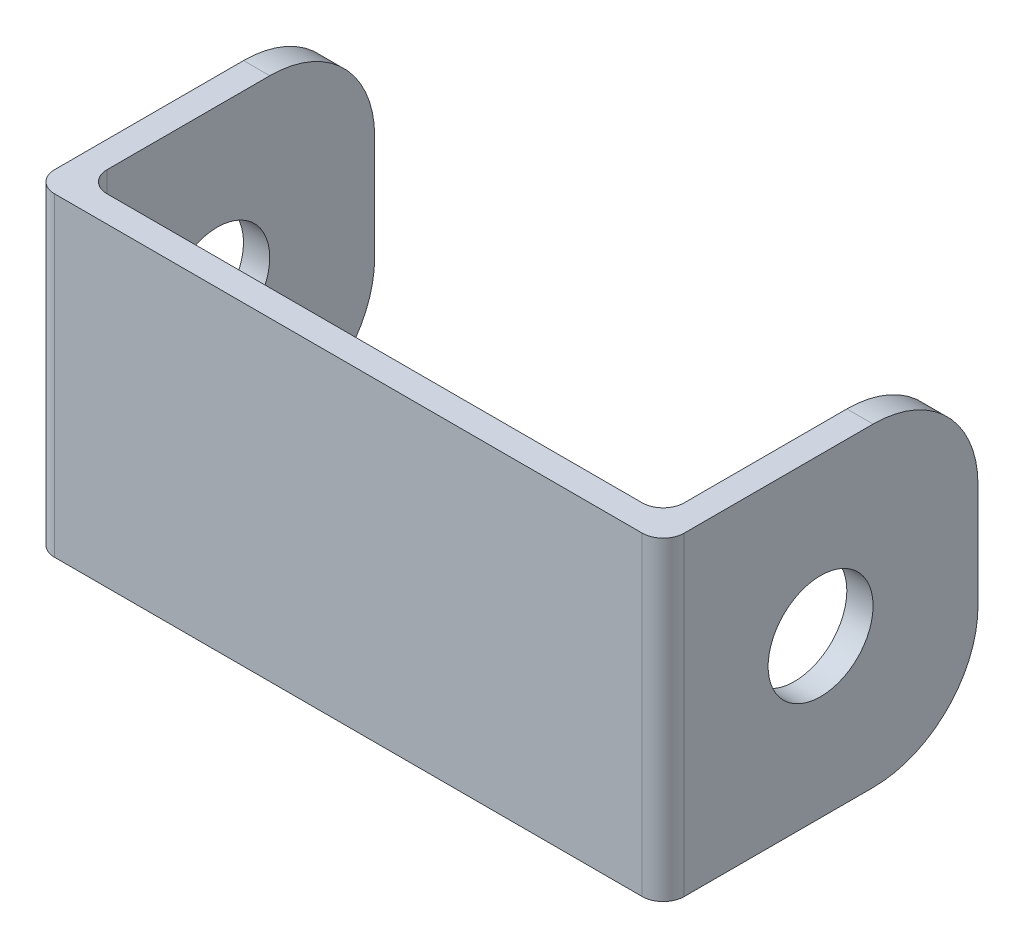
ISO-10303-21;
HEADER;
FILE_DESCRIPTION(('STEP AP214'),'2;1');
FILE_NAME('part.step','',(''),(''),'','','');
FILE_SCHEMA(('AUTOMOTIVE_DESIGN { 1 0 10303 214 1 1 1 1 }'));
ENDSEC;
DATA;
#1=APPLICATION_CONTEXT('core data for automotive mechanical design processes');
#2=APPLICATION_PROTOCOL_DEFINITION('international standard','automotive_design',2000,#1);
#3=PRODUCT_CONTEXT('',#1,'mechanical');
#4=PRODUCT('Part','Part','',(#3));
#5=PRODUCT_RELATED_PRODUCT_CATEGORY('part','',(#4));
#6=PRODUCT_DEFINITION_FORMATION('','',#4);
#7=PRODUCT_DEFINITION_CONTEXT('part definition',#1,'design');
#8=PRODUCT_DEFINITION('design','',#6,#7);
#9=PRODUCT_DEFINITION_SHAPE('','',#8);
#10=(LENGTH_UNIT() NAMED_UNIT(*) SI_UNIT(.MILLI.,.METRE.));
#11=(NAMED_UNIT(*) PLANE_ANGLE_UNIT() SI_UNIT($,.RADIAN.));
#12=(NAMED_UNIT(*) SI_UNIT($,.STERADIAN.) SOLID_ANGLE_UNIT());
#13=UNCERTAINTY_MEASURE_WITH_UNIT(LENGTH_MEASURE(1.E-05),#10,'distance_accuracy_value','');
#14=(GEOMETRIC_REPRESENTATION_CONTEXT(3) GLOBAL_UNCERTAINTY_ASSIGNED_CONTEXT((#13)) GLOBAL_UNIT_ASSIGNED_CONTEXT((#10,
#11,#12)) REPRESENTATION_CONTEXT('',''));
#15=CARTESIAN_POINT('',(0.,0.,0.));
#16=DIRECTION('',(0.,0.,1.));
#17=DIRECTION('',(1.,0.,0.));
#18=AXIS2_PLACEMENT_3D('',#15,#16,#17);
#19=CARTESIAN_POINT('',(-2.38125000000001,38.1,-27.9796875));
#20=DIRECTION('',(0.,0.,1.));
#21=DIRECTION('',(1.,0.,0.));
#22=AXIS2_PLACEMENT_3D('',#19,#20,#21);
#23=PLANE('',#22);
#24=DIRECTION('',(0.,-1.,0.));
#25=VECTOR('',#24,1.);
#26=CARTESIAN_POINT('',(-5.55625000000001,38.1,-27.9796875));
#27=LINE('',#26,#25);
#28=CARTESIAN_POINT('',(-5.55625000000001,25.4,-27.9796875));
#29=VERTEX_POINT('',#28);
#30=CARTESIAN_POINT('',(-5.55625000000001,12.7,-27.9796875));
#31=VERTEX_POINT('',#30);
#32=EDGE_CURVE('E209',#29,#31,#27,.T.);
#33=ORIENTED_EDGE('',*,*,#32,.F.);
#34=DIRECTION('',(-1.,0.,0.));
#35=VECTOR('',#34,1.);
#36=CARTESIAN_POINT('',(-2.38125000000001,25.4,-27.9796875));
#37=LINE('',#36,#35);
#38=CARTESIAN_POINT('',(-2.38125000000001,25.4,-27.9796875));
#39=VERTEX_POINT('',#38);
#40=EDGE_CURVE('E150',#29,#39,#37,.F.);
#41=ORIENTED_EDGE('',*,*,#40,.T.);
#42=DIRECTION('',(0.,-1.,0.));
#43=VECTOR('',#42,1.);
#44=CARTESIAN_POINT('',(-2.38125000000001,38.1,-27.9796875));
#45=LINE('',#44,#43);
#46=CARTESIAN_POINT('',(-2.38125000000001,12.7,-27.9796875));
#47=VERTEX_POINT('',#46);
#48=EDGE_CURVE('E189',#39,#47,#45,.T.);
#49=ORIENTED_EDGE('',*,*,#48,.T.);
#50=DIRECTION('',(-1.,0.,0.));
#51=VECTOR('',#50,1.);
#52=CARTESIAN_POINT('',(-2.38125000000001,12.7,-27.9796875));
#53=LINE('',#52,#51);
#54=EDGE_CURVE('E155',#47,#31,#53,.T.);
#55=ORIENTED_EDGE('',*,*,#54,.T.);
#56=EDGE_LOOP('',(#33,#41,#49,#55));
#57=FACE_BOUND('',#56,.T.);
#58=ADVANCED_FACE('F32',(#57),#23,.F.);
#59=CARTESIAN_POINT('',(-5.55625000000001,38.1,-27.9796875));
#60=DIRECTION('',(1.,0.,0.));
#61=DIRECTION('',(0.,0.,-1.));
#62=AXIS2_PLACEMENT_3D('',#59,#60,#61);
#63=PLANE('',#62);
#64=CARTESIAN_POINT('',(-5.55625000000003,19.05,-8.92968749999998));
#65=DIRECTION('',(1.,0.,0.));
#66=DIRECTION('',(0.,0.,-1.));
#67=AXIS2_PLACEMENT_3D('',#64,#65,#66);
#68=CIRCLE('',#67,6.35);
#69=CARTESIAN_POINT('',(-5.55625000000003,19.05,-15.2796875));
#70=VERTEX_POINT('',#69);
#71=EDGE_CURVE('E214',#70,#70,#68,.T.);
#72=ORIENTED_EDGE('',*,*,#71,.T.);
#73=EDGE_LOOP('',(#72));
#74=FACE_BOUND('',#73,.T.);
#75=DIRECTION('',(0.,0.,1.));
#76=VECTOR('',#75,1.);
#77=CARTESIAN_POINT('',(-5.55625000000001,0.,-27.9796875));
#78=LINE('',#77,#76);
#79=CARTESIAN_POINT('',(-5.55625000000001,0.,-15.2796875));
#80=VERTEX_POINT('',#79);
#81=CARTESIAN_POINT('',(-5.55625,0.,7.58031249999998));
#82=VERTEX_POINT('',#81);
#83=EDGE_CURVE('E190',#80,#82,#78,.T.);
#84=ORIENTED_EDGE('',*,*,#83,.T.);
#85=DIRECTION('',(0.,-1.,0.));
#86=VECTOR('',#85,1.);
#87=CARTESIAN_POINT('',(-5.55625,38.1,7.5803125));
#88=LINE('',#87,#86);
#89=CARTESIAN_POINT('',(-5.55625,38.1,7.58031249999998));
#90=VERTEX_POINT('',#89);
#91=EDGE_CURVE('E171',#82,#90,#88,.F.);
#92=ORIENTED_EDGE('',*,*,#91,.T.);
#93=DIRECTION('',(0.,0.,1.));
#94=VECTOR('',#93,1.);
#95=CARTESIAN_POINT('',(-5.55625000000001,38.1,-27.9796875));
#96=LINE('',#95,#94);
#97=CARTESIAN_POINT('',(-5.55625000000001,38.1,-15.2796875));
#98=VERTEX_POINT('',#97);
#99=EDGE_CURVE('E161',#98,#90,#96,.T.);
#100=ORIENTED_EDGE('',*,*,#99,.F.);
#101=CARTESIAN_POINT('',(-5.55625000000001,25.4,-15.2796875));
#102=DIRECTION('',(1.,0.,0.));
#103=DIRECTION('',(0.,0.,-1.));
#104=AXIS2_PLACEMENT_3D('',#101,#102,#103);
#105=CIRCLE('',#104,12.7);
#106=EDGE_CURVE('E145',#98,#29,#105,.F.);
#107=ORIENTED_EDGE('',*,*,#106,.T.);
#108=ORIENTED_EDGE('',*,*,#32,.T.);
#109=CARTESIAN_POINT('',(-5.55625000000001,12.7,-15.2796875));
#110=DIRECTION('',(1.,0.,0.));
#111=DIRECTION('',(0.,0.,-1.));
#112=AXIS2_PLACEMENT_3D('',#109,#110,#111);
#113=CIRCLE('',#112,12.7);
#114=EDGE_CURVE('E156',#31,#80,#113,.F.);
#115=ORIENTED_EDGE('',*,*,#114,.T.);
#116=EDGE_LOOP('',(#84,#92,#100,#107,#108,#115));
#117=FACE_BOUND('',#116,.T.);
#118=ADVANCED_FACE('F169',(#74,#117),#63,.F.);
#119=CARTESIAN_POINT('',(-5.55625,38.1,10.1203125));
#120=DIRECTION('',(0.,0.,-1.));
#121=DIRECTION('',(-1.,0.,0.));
#122=AXIS2_PLACEMENT_3D('',#119,#120,#121);
#123=PLANE('',#122);
#124=DIRECTION('',(1.,0.,0.));
#125=VECTOR('',#124,1.);
#126=CARTESIAN_POINT('',(-5.55625,0.,10.1203125));
#127=LINE('',#126,#125);
#128=CARTESIAN_POINT('',(-3.01625000000001,0.,10.1203125));
#129=VERTEX_POINT('',#128);
#130=CARTESIAN_POINT('',(68.10375,0.,10.1203125));
#131=VERTEX_POINT('',#130);
#132=EDGE_CURVE('E192',#129,#131,#127,.T.);
#133=ORIENTED_EDGE('',*,*,#132,.T.);
#134=DIRECTION('',(0.,-1.,0.));
#135=VECTOR('',#134,1.);
#136=CARTESIAN_POINT('',(68.10375,38.1,10.1203125));
#137=LINE('',#136,#135);
#138=CARTESIAN_POINT('',(68.10375,38.1,10.1203125));
#139=VERTEX_POINT('',#138);
#140=EDGE_CURVE('E255',#131,#139,#137,.F.);
#141=ORIENTED_EDGE('',*,*,#140,.T.);
#142=DIRECTION('',(1.,0.,0.));
#143=VECTOR('',#142,1.);
#144=CARTESIAN_POINT('',(-5.55625,38.1,10.1203125));
#145=LINE('',#144,#143);
#146=CARTESIAN_POINT('',(-3.01625000000001,38.1,10.1203125));
#147=VERTEX_POINT('',#146);
#148=EDGE_CURVE('E172',#147,#139,#145,.T.);
#149=ORIENTED_EDGE('',*,*,#148,.F.);
#150=DIRECTION('',(0.,-1.,0.));
#151=VECTOR('',#150,1.);
#152=CARTESIAN_POINT('',(-3.01625000000001,38.1,10.1203125));
#153=LINE('',#152,#151);
#154=EDGE_CURVE('E252',#147,#129,#153,.T.);
#155=ORIENTED_EDGE('',*,*,#154,.T.);
#156=EDGE_LOOP('',(#133,#141,#149,#155));
#157=FACE_BOUND('',#156,.T.);
#158=ADVANCED_FACE('F308',(#157),#123,.F.);
#159=CARTESIAN_POINT('',(70.64375,38.1,10.1203125));
#160=DIRECTION('',(-1.,0.,0.));
#161=DIRECTION('',(0.,0.,1.));
#162=AXIS2_PLACEMENT_3D('',#159,#160,#161);
#163=PLANE('',#162);
#164=CARTESIAN_POINT('',(70.64375,19.05,-8.92968750000001));
#165=DIRECTION('',(1.,0.,0.));
#166=DIRECTION('',(0.,0.,-1.));
#167=AXIS2_PLACEMENT_3D('',#164,#165,#166);
#168=CIRCLE('',#167,6.35);
#169=CARTESIAN_POINT('',(70.64375,19.05,-15.2796875));
#170=VERTEX_POINT('',#169);
#171=EDGE_CURVE('E498',#170,#170,#168,.T.);
#172=ORIENTED_EDGE('',*,*,#171,.F.);
#173=EDGE_LOOP('',(#172));
#174=FACE_BOUND('',#173,.T.);
#175=DIRECTION('',(0.,0.,-1.));
#176=VECTOR('',#175,1.);
#177=CARTESIAN_POINT('',(70.64375,38.1,10.1203125));
#178=LINE('',#177,#176);
#179=CARTESIAN_POINT('',(70.64375,38.1,7.58031250000001));
#180=VERTEX_POINT('',#179);
#181=CARTESIAN_POINT('',(70.64375,38.1,-15.2796875));
#182=VERTEX_POINT('',#181);
#183=EDGE_CURVE('E175',#180,#182,#178,.T.);
#184=ORIENTED_EDGE('',*,*,#183,.F.);
#185=DIRECTION('',(0.,-1.,0.));
#186=VECTOR('',#185,1.);
#187=CARTESIAN_POINT('',(70.64375,38.1,7.58031250000001));
#188=LINE('',#187,#186);
#189=CARTESIAN_POINT('',(70.64375,0.,7.58031250000001));
#190=VERTEX_POINT('',#189);
#191=EDGE_CURVE('E245',#180,#190,#188,.T.);
#192=ORIENTED_EDGE('',*,*,#191,.T.);
#193=DIRECTION('',(0.,0.,-1.));
#194=VECTOR('',#193,1.);
#195=CARTESIAN_POINT('',(70.64375,0.,10.1203125));
#196=LINE('',#195,#194);
#197=CARTESIAN_POINT('',(70.64375,0.,-15.2796875));
#198=VERTEX_POINT('',#197);
#199=EDGE_CURVE('E195',#190,#198,#196,.T.);
#200=ORIENTED_EDGE('',*,*,#199,.T.);
#201=CARTESIAN_POINT('',(70.64375,12.7,-15.2796875));
#202=DIRECTION('',(-1.,0.,0.));
#203=DIRECTION('',(0.,0.,1.));
#204=AXIS2_PLACEMENT_3D('',#201,#202,#203);
#205=CIRCLE('',#204,12.7);
#206=CARTESIAN_POINT('',(70.64375,12.7,-27.9796875));
#207=VERTEX_POINT('',#206);
#208=EDGE_CURVE('E243',#198,#207,#205,.F.);
#209=ORIENTED_EDGE('',*,*,#208,.T.);
#210=DIRECTION('',(0.,-1.,0.));
#211=VECTOR('',#210,1.);
#212=CARTESIAN_POINT('',(70.64375,38.1,-27.9796875));
#213=LINE('',#212,#211);
#214=CARTESIAN_POINT('',(70.64375,25.4,-27.9796875));
#215=VERTEX_POINT('',#214);
#216=EDGE_CURVE('E206',#215,#207,#213,.T.);
#217=ORIENTED_EDGE('',*,*,#216,.F.);
#218=CARTESIAN_POINT('',(70.64375,25.4,-15.2796875));
#219=DIRECTION('',(-1.,0.,0.));
#220=DIRECTION('',(0.,0.,1.));
#221=AXIS2_PLACEMENT_3D('',#218,#219,#220);
#222=CIRCLE('',#221,12.7);
#223=EDGE_CURVE('E240',#215,#182,#222,.F.);
#224=ORIENTED_EDGE('',*,*,#223,.T.);
#225=EDGE_LOOP('',(#184,#192,#200,#209,#217,#224));
#226=FACE_BOUND('',#225,.T.);
#227=ADVANCED_FACE('F316',(#174,#226),#163,.F.);
#228=CARTESIAN_POINT('',(70.64375,38.1,-27.9796875));
#229=DIRECTION('',(0.,0.,1.));
#230=DIRECTION('',(1.,0.,0.));
#231=AXIS2_PLACEMENT_3D('',#228,#229,#230);
#232=PLANE('',#231);
#233=ORIENTED_EDGE('',*,*,#216,.T.);
#234=DIRECTION('',(-1.,0.,0.));
#235=VECTOR('',#234,1.);
#236=CARTESIAN_POINT('',(70.64375,12.7,-27.9796875));
#237=LINE('',#236,#235);
#238=CARTESIAN_POINT('',(67.46875,12.7,-27.9796875));
#239=VERTEX_POINT('',#238);
#240=EDGE_CURVE('E233',#207,#239,#237,.T.);
#241=ORIENTED_EDGE('',*,*,#240,.T.);
#242=DIRECTION('',(0.,-1.,0.));
#243=VECTOR('',#242,1.);
#244=CARTESIAN_POINT('',(67.46875,38.1,-27.9796875));
#245=LINE('',#244,#243);
#246=CARTESIAN_POINT('',(67.46875,25.4,-27.9796875));
#247=VERTEX_POINT('',#246);
#248=EDGE_CURVE('E203',#247,#239,#245,.T.);
#249=ORIENTED_EDGE('',*,*,#248,.F.);
#250=DIRECTION('',(-1.,0.,0.));
#251=VECTOR('',#250,1.);
#252=CARTESIAN_POINT('',(70.64375,25.4,-27.9796875));
#253=LINE('',#252,#251);
#254=EDGE_CURVE('E231',#247,#215,#253,.F.);
#255=ORIENTED_EDGE('',*,*,#254,.T.);
#256=EDGE_LOOP('',(#233,#241,#249,#255));
#257=FACE_BOUND('',#256,.T.);
#258=ADVANCED_FACE('F325',(#257),#232,.F.);
#259=CARTESIAN_POINT('',(67.46875,38.1,-27.9796875));
#260=DIRECTION('',(1.,0.,0.));
#261=DIRECTION('',(0.,0.,-1.));
#262=AXIS2_PLACEMENT_3D('',#259,#260,#261);
#263=PLANE('',#262);
#264=CARTESIAN_POINT('',(67.46875,19.05,-8.9296875));
#265=DIRECTION('',(1.,0.,0.));
#266=DIRECTION('',(0.,0.,-1.));
#267=AXIS2_PLACEMENT_3D('',#264,#265,#266);
#268=CIRCLE('',#267,6.35);
#269=CARTESIAN_POINT('',(67.46875,19.05,-15.2796875));
#270=VERTEX_POINT('',#269);
#271=EDGE_CURVE('E180',#270,#270,#268,.T.);
#272=ORIENTED_EDGE('',*,*,#271,.T.);
#273=EDGE_LOOP('',(#272));
#274=FACE_BOUND('',#273,.T.);
#275=DIRECTION('',(0.,0.,1.));
#276=VECTOR('',#275,1.);
#277=CARTESIAN_POINT('',(67.46875,0.,-27.9796875));
#278=LINE('',#277,#276);
#279=CARTESIAN_POINT('',(67.46875,0.,-15.2796875));
#280=VERTEX_POINT('',#279);
#281=CARTESIAN_POINT('',(67.46875,0.,4.40531249999998));
#282=VERTEX_POINT('',#281);
#283=EDGE_CURVE('E197',#280,#282,#278,.T.);
#284=ORIENTED_EDGE('',*,*,#283,.T.);
#285=DIRECTION('',(0.,-1.,0.));
#286=VECTOR('',#285,1.);
#287=CARTESIAN_POINT('',(67.46875,38.1,4.4053125));
#288=LINE('',#287,#286);
#289=CARTESIAN_POINT('',(67.46875,38.1,4.40531249999998));
#290=VERTEX_POINT('',#289);
#291=EDGE_CURVE('E269',#282,#290,#288,.F.);
#292=ORIENTED_EDGE('',*,*,#291,.T.);
#293=DIRECTION('',(0.,0.,1.));
#294=VECTOR('',#293,1.);
#295=CARTESIAN_POINT('',(67.46875,38.1,-27.9796875));
#296=LINE('',#295,#294);
#297=CARTESIAN_POINT('',(67.46875,38.1,-15.2796875));
#298=VERTEX_POINT('',#297);
#299=EDGE_CURVE('E184',#298,#290,#296,.T.);
#300=ORIENTED_EDGE('',*,*,#299,.F.);
#301=CARTESIAN_POINT('',(67.46875,25.4,-15.2796875));
#302=DIRECTION('',(1.,0.,0.));
#303=DIRECTION('',(0.,0.,-1.));
#304=AXIS2_PLACEMENT_3D('',#301,#302,#303);
#305=CIRCLE('',#304,12.7);
#306=EDGE_CURVE('E236',#298,#247,#305,.F.);
#307=ORIENTED_EDGE('',*,*,#306,.T.);
#308=ORIENTED_EDGE('',*,*,#248,.T.);
#309=CARTESIAN_POINT('',(67.46875,12.7,-15.2796875));
#310=DIRECTION('',(1.,0.,0.));
#311=DIRECTION('',(0.,0.,-1.));
#312=AXIS2_PLACEMENT_3D('',#309,#310,#311);
#313=CIRCLE('',#312,12.7);
#314=EDGE_CURVE('E238',#239,#280,#313,.F.);
#315=ORIENTED_EDGE('',*,*,#314,.T.);
#316=EDGE_LOOP('',(#284,#292,#300,#307,#308,#315));
#317=FACE_BOUND('',#316,.T.);
#318=ADVANCED_FACE('F284',(#274,#317),#263,.F.);
#319=CARTESIAN_POINT('',(67.46875,38.1,6.9453125));
#320=DIRECTION('',(0.,0.,1.));
#321=DIRECTION('',(1.,0.,0.));
#322=AXIS2_PLACEMENT_3D('',#319,#320,#321);
#323=PLANE('',#322);
#324=DIRECTION('',(-1.,0.,0.));
#325=VECTOR('',#324,1.);
#326=CARTESIAN_POINT('',(67.46875,0.,6.9453125));
#327=LINE('',#326,#325);
#328=CARTESIAN_POINT('',(64.92875,0.,6.9453125));
#329=VERTEX_POINT('',#328);
#330=CARTESIAN_POINT('',(0.158749999999999,0.,6.9453125));
#331=VERTEX_POINT('',#330);
#332=EDGE_CURVE('E177',#329,#331,#327,.T.);
#333=ORIENTED_EDGE('',*,*,#332,.T.);
#334=DIRECTION('',(0.,-1.,0.));
#335=VECTOR('',#334,1.);
#336=CARTESIAN_POINT('',(0.158750000000001,38.1,6.9453125));
#337=LINE('',#336,#335);
#338=CARTESIAN_POINT('',(0.158749999999999,38.1,6.9453125));
#339=VERTEX_POINT('',#338);
#340=EDGE_CURVE('E47',#331,#339,#337,.F.);
#341=ORIENTED_EDGE('',*,*,#340,.T.);
#342=DIRECTION('',(-1.,0.,0.));
#343=VECTOR('',#342,1.);
#344=CARTESIAN_POINT('',(67.46875,38.1,6.9453125));
#345=LINE('',#344,#343);
#346=CARTESIAN_POINT('',(64.92875,38.1,6.9453125));
#347=VERTEX_POINT('',#346);
#348=EDGE_CURVE('E186',#347,#339,#345,.T.);
#349=ORIENTED_EDGE('',*,*,#348,.F.);
#350=DIRECTION('',(0.,-1.,0.));
#351=VECTOR('',#350,1.);
#352=CARTESIAN_POINT('',(64.92875,0.,6.9453125));
#353=LINE('',#352,#351);
#354=EDGE_CURVE('E265',#347,#329,#353,.T.);
#355=ORIENTED_EDGE('',*,*,#354,.T.);
#356=EDGE_LOOP('',(#333,#341,#349,#355));
#357=FACE_BOUND('',#356,.T.);
#358=ADVANCED_FACE('F286',(#357),#323,.F.);
#359=CARTESIAN_POINT('',(-2.38125,38.1,6.9453125));
#360=DIRECTION('',(-1.,0.,0.));
#361=DIRECTION('',(0.,0.,1.));
#362=AXIS2_PLACEMENT_3D('',#359,#360,#361);
#363=PLANE('',#362);
#364=CARTESIAN_POINT('',(-2.38125,19.05,-8.92968749999998));
#365=DIRECTION('',(-1.,0.,0.));
#366=DIRECTION('',(0.,0.,1.));
#367=AXIS2_PLACEMENT_3D('',#364,#365,#366);
#368=CIRCLE('',#367,6.35);
#369=CARTESIAN_POINT('',(-2.38125,19.05,-2.57968749999998));
#370=VERTEX_POINT('',#369);
#371=EDGE_CURVE('E211',#370,#370,#368,.T.);
#372=ORIENTED_EDGE('',*,*,#371,.T.);
#373=EDGE_LOOP('',(#372));
#374=FACE_BOUND('',#373,.T.);
#375=DIRECTION('',(0.,0.,-1.));
#376=VECTOR('',#375,1.);
#377=CARTESIAN_POINT('',(-2.38125,38.1,6.9453125));
#378=LINE('',#377,#376);
#379=CARTESIAN_POINT('',(-2.38125,38.1,4.4053125));
#380=VERTEX_POINT('',#379);
#381=CARTESIAN_POINT('',(-2.38125000000001,38.1,-15.2796875));
#382=VERTEX_POINT('',#381);
#383=EDGE_CURVE('E164',#380,#382,#378,.T.);
#384=ORIENTED_EDGE('',*,*,#383,.F.);
#385=DIRECTION('',(0.,-1.,0.));
#386=VECTOR('',#385,1.);
#387=CARTESIAN_POINT('',(-2.38125,0.,4.4053125));
#388=LINE('',#387,#386);
#389=CARTESIAN_POINT('',(-2.38125,0.,4.4053125));
#390=VERTEX_POINT('',#389);
#391=EDGE_CURVE('E262',#380,#390,#388,.T.);
#392=ORIENTED_EDGE('',*,*,#391,.T.);
#393=DIRECTION('',(0.,0.,-1.));
#394=VECTOR('',#393,1.);
#395=CARTESIAN_POINT('',(-2.38125,0.,6.9453125));
#396=LINE('',#395,#394);
#397=CARTESIAN_POINT('',(-2.38125000000001,0.,-15.2796875));
#398=VERTEX_POINT('',#397);
#399=EDGE_CURVE('E173',#390,#398,#396,.T.);
#400=ORIENTED_EDGE('',*,*,#399,.T.);
#401=CARTESIAN_POINT('',(-2.38125000000001,12.7,-15.2796875));
#402=DIRECTION('',(-1.,0.,0.));
#403=DIRECTION('',(0.,0.,1.));
#404=AXIS2_PLACEMENT_3D('',#401,#402,#403);
#405=CIRCLE('',#404,12.7);
#406=EDGE_CURVE('E221',#398,#47,#405,.F.);
#407=ORIENTED_EDGE('',*,*,#406,.T.);
#408=ORIENTED_EDGE('',*,*,#48,.F.);
#409=CARTESIAN_POINT('',(-2.38125000000001,25.4,-15.2796875));
#410=DIRECTION('',(-1.,0.,0.));
#411=DIRECTION('',(0.,0.,1.));
#412=AXIS2_PLACEMENT_3D('',#409,#410,#411);
#413=CIRCLE('',#412,12.7);
#414=EDGE_CURVE('E223',#39,#382,#413,.F.);
#415=ORIENTED_EDGE('',*,*,#414,.T.);
#416=EDGE_LOOP('',(#384,#392,#400,#407,#408,#415));
#417=FACE_BOUND('',#416,.T.);
#418=ADVANCED_FACE('F293',(#374,#417),#363,.F.);
#419=CARTESIAN_POINT('',(0.,38.1,0.));
#420=DIRECTION('',(0.,1.,0.));
#421=DIRECTION('',(0.,0.,1.));
#422=AXIS2_PLACEMENT_3D('',#419,#420,#421);
#423=PLANE('',#422);
#424=ORIENTED_EDGE('',*,*,#148,.T.);
#425=CARTESIAN_POINT('',(68.10375,38.1,7.58031250000001));
#426=DIRECTION('',(0.,1.,0.));
#427=DIRECTION('',(0.,0.,1.));
#428=AXIS2_PLACEMENT_3D('',#425,#426,#427);
#429=CIRCLE('',#428,2.54);
#430=EDGE_CURVE('E259',#139,#180,#429,.T.);
#431=ORIENTED_EDGE('',*,*,#430,.T.);
#432=ORIENTED_EDGE('',*,*,#183,.T.);
#433=DIRECTION('',(-1.,0.,0.));
#434=VECTOR('',#433,1.);
#435=CARTESIAN_POINT('',(67.46875,38.1,-15.2796875));
#436=LINE('',#435,#434);
#437=EDGE_CURVE('E166',#182,#298,#436,.T.);
#438=ORIENTED_EDGE('',*,*,#437,.T.);
#439=ORIENTED_EDGE('',*,*,#299,.T.);
#440=CARTESIAN_POINT('',(64.92875,38.1,4.4053125));
#441=DIRECTION('',(0.,1.,0.));
#442=DIRECTION('',(0.,0.,1.));
#443=AXIS2_PLACEMENT_3D('',#440,#441,#442);
#444=CIRCLE('',#443,2.54);
#445=EDGE_CURVE('E11',#290,#347,#444,.F.);
#446=ORIENTED_EDGE('',*,*,#445,.T.);
#447=ORIENTED_EDGE('',*,*,#348,.T.);
#448=CARTESIAN_POINT('',(0.158750000000001,38.1,4.4053125));
#449=DIRECTION('',(0.,1.,0.));
#450=DIRECTION('',(0.,0.,1.));
#451=AXIS2_PLACEMENT_3D('',#448,#449,#450);
#452=CIRCLE('',#451,2.54);
#453=EDGE_CURVE('E273',#339,#380,#452,.F.);
#454=ORIENTED_EDGE('',*,*,#453,.T.);
#455=ORIENTED_EDGE('',*,*,#383,.T.);
#456=DIRECTION('',(-1.,0.,0.));
#457=VECTOR('',#456,1.);
#458=CARTESIAN_POINT('',(-5.55625000000001,38.1,-15.2796875));
#459=LINE('',#458,#457);
#460=EDGE_CURVE('E149',#382,#98,#459,.T.);
#461=ORIENTED_EDGE('',*,*,#460,.T.);
#462=ORIENTED_EDGE('',*,*,#99,.T.);
#463=CARTESIAN_POINT('',(-3.01625000000001,38.1,7.5803125));
#464=DIRECTION('',(0.,1.,0.));
#465=DIRECTION('',(0.,0.,1.));
#466=AXIS2_PLACEMENT_3D('',#463,#464,#465);
#467=CIRCLE('',#466,2.54);
#468=EDGE_CURVE('E257',#90,#147,#467,.T.);
#469=ORIENTED_EDGE('',*,*,#468,.T.);
#470=EDGE_LOOP('',(#424,#431,#432,#438,#439,#446,#447,#454,#455,#461,#462,#469));
#471=FACE_BOUND('',#470,.T.);
#472=ADVANCED_FACE('F160',(#471),#423,.T.);
#473=CARTESIAN_POINT('',(0.,0.,0.));
#474=DIRECTION('',(0.,1.,0.));
#475=DIRECTION('',(0.,0.,1.));
#476=AXIS2_PLACEMENT_3D('',#473,#474,#475);
#477=PLANE('',#476);
#478=ORIENTED_EDGE('',*,*,#199,.F.);
#479=CARTESIAN_POINT('',(68.10375,0.,7.58031250000001));
#480=DIRECTION('',(0.,1.,0.));
#481=DIRECTION('',(0.,0.,1.));
#482=AXIS2_PLACEMENT_3D('',#479,#480,#481);
#483=CIRCLE('',#482,2.54);
#484=EDGE_CURVE('E250',#190,#131,#483,.F.);
#485=ORIENTED_EDGE('',*,*,#484,.T.);
#486=ORIENTED_EDGE('',*,*,#132,.F.);
#487=CARTESIAN_POINT('',(-3.01625000000001,0.,7.5803125));
#488=DIRECTION('',(0.,1.,0.));
#489=DIRECTION('',(0.,0.,1.));
#490=AXIS2_PLACEMENT_3D('',#487,#488,#489);
#491=CIRCLE('',#490,2.54);
#492=EDGE_CURVE('E248',#129,#82,#491,.F.);
#493=ORIENTED_EDGE('',*,*,#492,.T.);
#494=ORIENTED_EDGE('',*,*,#83,.F.);
#495=DIRECTION('',(-1.,0.,0.));
#496=VECTOR('',#495,1.);
#497=CARTESIAN_POINT('',(0.,0.,-15.2796875));
#498=LINE('',#497,#496);
#499=EDGE_CURVE('E228',#80,#398,#498,.F.);
#500=ORIENTED_EDGE('',*,*,#499,.T.);
#501=ORIENTED_EDGE('',*,*,#399,.F.);
#502=CARTESIAN_POINT('',(0.158750000000001,0.,4.4053125));
#503=DIRECTION('',(0.,1.,0.));
#504=DIRECTION('',(0.,0.,1.));
#505=AXIS2_PLACEMENT_3D('',#502,#503,#504);
#506=CIRCLE('',#505,2.54);
#507=EDGE_CURVE('E271',#390,#331,#506,.T.);
#508=ORIENTED_EDGE('',*,*,#507,.T.);
#509=ORIENTED_EDGE('',*,*,#332,.F.);
#510=CARTESIAN_POINT('',(64.92875,0.,4.4053125));
#511=DIRECTION('',(0.,1.,0.));
#512=DIRECTION('',(0.,0.,1.));
#513=AXIS2_PLACEMENT_3D('',#510,#511,#512);
#514=CIRCLE('',#513,2.54);
#515=EDGE_CURVE('E40',#329,#282,#514,.T.);
#516=ORIENTED_EDGE('',*,*,#515,.T.);
#517=ORIENTED_EDGE('',*,*,#283,.F.);
#518=DIRECTION('',(-1.,0.,0.));
#519=VECTOR('',#518,1.);
#520=CARTESIAN_POINT('',(0.,0.,-15.2796875));
#521=LINE('',#520,#519);
#522=EDGE_CURVE('E225',#280,#198,#521,.F.);
#523=ORIENTED_EDGE('',*,*,#522,.T.);
#524=EDGE_LOOP('',(#478,#485,#486,#493,#494,#500,#501,#508,#509,#516,#517,#523));
#525=FACE_BOUND('',#524,.T.);
#526=ADVANCED_FACE('F278',(#525),#477,.F.);
#527=CARTESIAN_POINT('',(-5.55625000000003,19.05,-8.92968749999998));
#528=DIRECTION('',(1.,0.,0.));
#529=DIRECTION('',(0.,0.,-1.));
#530=AXIS2_PLACEMENT_3D('',#527,#528,#529);
#531=CYLINDRICAL_SURFACE('',#530,6.35);
#532=ORIENTED_EDGE('',*,*,#71,.F.);
#533=EDGE_LOOP('',(#532));
#534=FACE_BOUND('',#533,.T.);
#535=ORIENTED_EDGE('',*,*,#371,.F.);
#536=EDGE_LOOP('',(#535));
#537=FACE_BOUND('',#536,.T.);
#538=ADVANCED_FACE('F352',(#534,#537),#531,.F.);
#539=ORIENTED_EDGE('',*,*,#171,.T.);
#540=EDGE_LOOP('',(#539));
#541=FACE_BOUND('',#540,.T.);
#542=ORIENTED_EDGE('',*,*,#271,.F.);
#543=EDGE_LOOP('',(#542));
#544=FACE_BOUND('',#543,.T.);
#545=ADVANCED_FACE('F348',(#541,#544),#531,.F.);
#546=CARTESIAN_POINT('',(0.,25.4,-15.2796875));
#547=DIRECTION('',(1.,0.,0.));
#548=DIRECTION('',(0.,0.,-1.));
#549=AXIS2_PLACEMENT_3D('',#546,#547,#548);
#550=CYLINDRICAL_SURFACE('',#549,12.7);
#551=ORIENTED_EDGE('',*,*,#414,.F.);
#552=ORIENTED_EDGE('',*,*,#40,.F.);
#553=ORIENTED_EDGE('',*,*,#106,.F.);
#554=ORIENTED_EDGE('',*,*,#460,.F.);
#555=EDGE_LOOP('',(#551,#552,#553,#554));
#556=FACE_BOUND('',#555,.T.);
#557=ADVANCED_FACE('F148',(#556),#550,.T.);
#558=CARTESIAN_POINT('',(-2.38125000000001,12.7,-15.2796875));
#559=DIRECTION('',(-1.,0.,0.));
#560=DIRECTION('',(0.,0.,1.));
#561=AXIS2_PLACEMENT_3D('',#558,#559,#560);
#562=CYLINDRICAL_SURFACE('',#561,12.7);
#563=ORIENTED_EDGE('',*,*,#406,.F.);
#564=ORIENTED_EDGE('',*,*,#499,.F.);
#565=ORIENTED_EDGE('',*,*,#114,.F.);
#566=ORIENTED_EDGE('',*,*,#54,.F.);
#567=EDGE_LOOP('',(#563,#564,#565,#566));
#568=FACE_BOUND('',#567,.T.);
#569=ADVANCED_FACE('F299',(#568),#562,.T.);
#570=CARTESIAN_POINT('',(70.64375,12.7,-15.2796875));
#571=DIRECTION('',(-1.,0.,0.));
#572=DIRECTION('',(0.,0.,1.));
#573=AXIS2_PLACEMENT_3D('',#570,#571,#572);
#574=CYLINDRICAL_SURFACE('',#573,12.7);
#575=ORIENTED_EDGE('',*,*,#208,.F.);
#576=ORIENTED_EDGE('',*,*,#522,.F.);
#577=ORIENTED_EDGE('',*,*,#314,.F.);
#578=ORIENTED_EDGE('',*,*,#240,.F.);
#579=EDGE_LOOP('',(#575,#576,#577,#578));
#580=FACE_BOUND('',#579,.T.);
#581=ADVANCED_FACE('F329',(#580),#574,.T.);
#582=CARTESIAN_POINT('',(0.,25.4,-15.2796875));
#583=DIRECTION('',(1.,0.,0.));
#584=DIRECTION('',(0.,0.,-1.));
#585=AXIS2_PLACEMENT_3D('',#582,#583,#584);
#586=CYLINDRICAL_SURFACE('',#585,12.7);
#587=ORIENTED_EDGE('',*,*,#223,.F.);
#588=ORIENTED_EDGE('',*,*,#254,.F.);
#589=ORIENTED_EDGE('',*,*,#306,.F.);
#590=ORIENTED_EDGE('',*,*,#437,.F.);
#591=EDGE_LOOP('',(#587,#588,#589,#590));
#592=FACE_BOUND('',#591,.T.);
#593=ADVANCED_FACE('F322',(#592),#586,.T.);
#594=CARTESIAN_POINT('',(68.10375,38.1,7.58031250000001));
#595=DIRECTION('',(0.,-1.,0.));
#596=DIRECTION('',(0.,0.,-1.));
#597=AXIS2_PLACEMENT_3D('',#594,#595,#596);
#598=CYLINDRICAL_SURFACE('',#597,2.54);
#599=ORIENTED_EDGE('',*,*,#430,.F.);
#600=ORIENTED_EDGE('',*,*,#140,.F.);
#601=ORIENTED_EDGE('',*,*,#484,.F.);
#602=ORIENTED_EDGE('',*,*,#191,.F.);
#603=EDGE_LOOP('',(#599,#600,#601,#602));
#604=FACE_BOUND('',#603,.T.);
#605=ADVANCED_FACE('F312',(#604),#598,.T.);
#606=CARTESIAN_POINT('',(-3.01625000000001,38.1,7.5803125));
#607=DIRECTION('',(0.,-1.,0.));
#608=DIRECTION('',(0.,0.,-1.));
#609=AXIS2_PLACEMENT_3D('',#606,#607,#608);
#610=CYLINDRICAL_SURFACE('',#609,2.54);
#611=ORIENTED_EDGE('',*,*,#468,.F.);
#612=ORIENTED_EDGE('',*,*,#91,.F.);
#613=ORIENTED_EDGE('',*,*,#492,.F.);
#614=ORIENTED_EDGE('',*,*,#154,.F.);
#615=EDGE_LOOP('',(#611,#612,#613,#614));
#616=FACE_BOUND('',#615,.T.);
#617=ADVANCED_FACE('F303',(#616),#610,.T.);
#618=CARTESIAN_POINT('',(0.158750000000001,38.1,4.4053125));
#619=DIRECTION('',(0.,1.,0.));
#620=DIRECTION('',(0.,0.,1.));
#621=AXIS2_PLACEMENT_3D('',#618,#619,#620);
#622=CYLINDRICAL_SURFACE('',#621,2.54);
#623=ORIENTED_EDGE('',*,*,#453,.F.);
#624=ORIENTED_EDGE('',*,*,#340,.F.);
#625=ORIENTED_EDGE('',*,*,#507,.F.);
#626=ORIENTED_EDGE('',*,*,#391,.F.);
#627=EDGE_LOOP('',(#623,#624,#625,#626));
#628=FACE_BOUND('',#627,.T.);
#629=ADVANCED_FACE('F290',(#628),#622,.F.);
#630=CARTESIAN_POINT('',(64.92875,38.1,4.4053125));
#631=DIRECTION('',(0.,1.,0.));
#632=DIRECTION('',(0.,0.,1.));
#633=AXIS2_PLACEMENT_3D('',#630,#631,#632);
#634=CYLINDRICAL_SURFACE('',#633,2.54);
#635=ORIENTED_EDGE('',*,*,#445,.F.);
#636=ORIENTED_EDGE('',*,*,#291,.F.);
#637=ORIENTED_EDGE('',*,*,#515,.F.);
#638=ORIENTED_EDGE('',*,*,#354,.F.);
#639=EDGE_LOOP('',(#635,#636,#637,#638));
#640=FACE_BOUND('',#639,.T.);
#641=ADVANCED_FACE('F34',(#640),#634,.F.);
#642=CLOSED_SHELL('',(#58,#118,#158,#227,#258,#318,#358,#418,#472,#526,#538,#545,#557,#569,#581,
#593,#605,#617,#629,#641));
#643=MANIFOLD_SOLID_BREP('B2',#642);
#644=ADVANCED_BREP_SHAPE_REPRESENTATION('',(#18,#643),#14);
#645=SHAPE_DEFINITION_REPRESENTATION(#9,#644);
ENDSEC;
END-ISO-10303-21;
